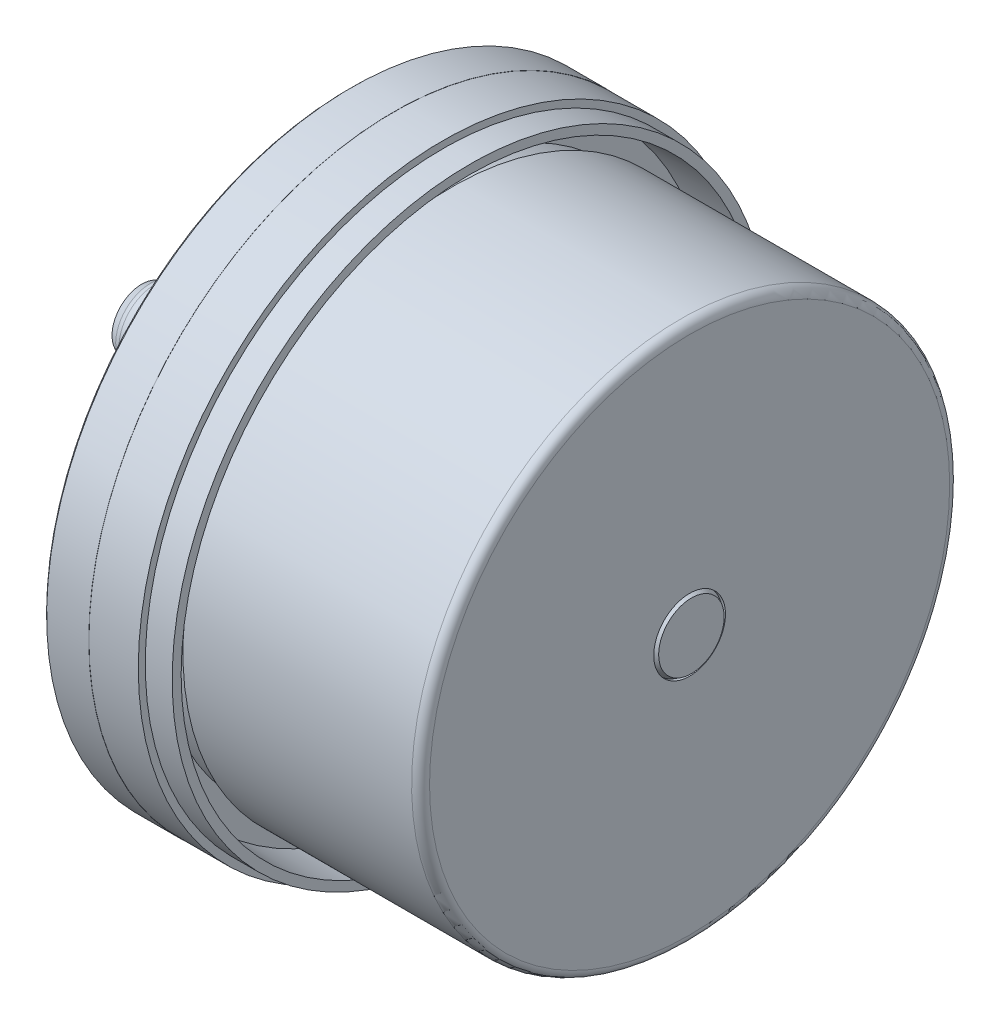
ISO-10303-21;
HEADER;
FILE_DESCRIPTION(('STEP AP214'),'2;1');
FILE_NAME('part.step','',(''),(''),'','','');
FILE_SCHEMA(('AUTOMOTIVE_DESIGN { 1 0 10303 214 1 1 1 1 }'));
ENDSEC;
DATA;
#1=APPLICATION_CONTEXT('core data for automotive mechanical design processes');
#2=APPLICATION_PROTOCOL_DEFINITION('international standard','automotive_design',2000,#1);
#3=PRODUCT_CONTEXT('',#1,'mechanical');
#4=PRODUCT('Part','Part','',(#3));
#5=PRODUCT_RELATED_PRODUCT_CATEGORY('part','',(#4));
#6=PRODUCT_DEFINITION_FORMATION('','',#4);
#7=PRODUCT_DEFINITION_CONTEXT('part definition',#1,'design');
#8=PRODUCT_DEFINITION('design','',#6,#7);
#9=PRODUCT_DEFINITION_SHAPE('','',#8);
#10=(LENGTH_UNIT() NAMED_UNIT(*) SI_UNIT(.MILLI.,.METRE.));
#11=(NAMED_UNIT(*) PLANE_ANGLE_UNIT() SI_UNIT($,.RADIAN.));
#12=(NAMED_UNIT(*) SI_UNIT($,.STERADIAN.) SOLID_ANGLE_UNIT());
#13=UNCERTAINTY_MEASURE_WITH_UNIT(LENGTH_MEASURE(1.E-05),#10,'distance_accuracy_value','');
#14=(GEOMETRIC_REPRESENTATION_CONTEXT(3) GLOBAL_UNCERTAINTY_ASSIGNED_CONTEXT((#13)) GLOBAL_UNIT_ASSIGNED_CONTEXT((#10,
#11,#12)) REPRESENTATION_CONTEXT('',''));
#15=CARTESIAN_POINT('',(0.,0.,0.));
#16=DIRECTION('',(0.,0.,1.));
#17=DIRECTION('',(1.,0.,0.));
#18=AXIS2_PLACEMENT_3D('',#15,#16,#17);
#19=CARTESIAN_POINT('',(38.2,0.,0.));
#20=DIRECTION('',(1.,0.,0.));
#21=DIRECTION('',(0.,0.,-1.));
#22=AXIS2_PLACEMENT_3D('',#19,#20,#21);
#23=PLANE('',#22);
#24=CARTESIAN_POINT('',(38.2000000000176,0.,0.));
#25=DIRECTION('',(-1.,0.,0.));
#26=DIRECTION('',(0.,0.,1.));
#27=AXIS2_PLACEMENT_3D('',#24,#25,#26);
#28=CIRCLE('',#27,3.65358983846758);
#29=CARTESIAN_POINT('',(38.2000000000176,0.,3.65358983846758));
#30=VERTEX_POINT('',#29);
#31=EDGE_CURVE('E276',#30,#30,#28,.T.);
#32=ORIENTED_EDGE('',*,*,#31,.F.);
#33=EDGE_LOOP('',(#32));
#34=FACE_BOUND('',#33,.T.);
#35=ADVANCED_FACE('F16',(#34),#23,.T.);
#36=CARTESIAN_POINT('',(37.600000000225,0.,0.));
#37=DIRECTION('',(-1.,0.,0.));
#38=DIRECTION('',(0.,0.,1.));
#39=AXIS2_PLACEMENT_3D('',#36,#37,#38);
#40=CONICAL_SURFACE('',#39,3.99999999984857,0.523598775582039);
#41=CARTESIAN_POINT('',(37.6,0.,0.));
#42=DIRECTION('',(1.,0.,0.));
#43=DIRECTION('',(0.,0.,-1.));
#44=AXIS2_PLACEMENT_3D('',#41,#42,#43);
#45=CIRCLE('',#44,4.);
#46=CARTESIAN_POINT('',(37.6,0.,-4.));
#47=VERTEX_POINT('',#46);
#48=EDGE_CURVE('E279',#47,#47,#45,.T.);
#49=ORIENTED_EDGE('',*,*,#48,.T.);
#50=EDGE_LOOP('',(#49));
#51=FACE_BOUND('',#50,.T.);
#52=ORIENTED_EDGE('',*,*,#31,.T.);
#53=EDGE_LOOP('',(#52));
#54=FACE_BOUND('',#53,.T.);
#55=ADVANCED_FACE('F97',(#51,#54),#40,.T.);
#56=CARTESIAN_POINT('',(-26.165,0.,0.));
#57=DIRECTION('',(1.,0.,0.));
#58=DIRECTION('',(0.,0.,-1.));
#59=AXIS2_PLACEMENT_3D('',#56,#57,#58);
#60=CYLINDRICAL_SURFACE('',#59,4.);
#61=CARTESIAN_POINT('',(38.,0.,0.));
#62=DIRECTION('',(1.,0.,0.));
#63=DIRECTION('',(0.,0.,-1.));
#64=AXIS2_PLACEMENT_3D('',#61,#62,#63);
#65=CIRCLE('',#64,4.);
#66=CARTESIAN_POINT('',(38.,0.,-4.));
#67=VERTEX_POINT('',#66);
#68=EDGE_CURVE('E68',#67,#67,#65,.F.);
#69=ORIENTED_EDGE('',*,*,#68,.F.);
#70=EDGE_LOOP('',(#69));
#71=FACE_BOUND('',#70,.T.);
#72=ORIENTED_EDGE('',*,*,#48,.F.);
#73=EDGE_LOOP('',(#72));
#74=FACE_BOUND('',#73,.T.);
#75=ADVANCED_FACE('F84',(#71,#74),#60,.F.);
#76=CARTESIAN_POINT('',(38.,0.,0.));
#77=DIRECTION('',(1.,0.,0.));
#78=DIRECTION('',(0.,0.,-1.));
#79=AXIS2_PLACEMENT_3D('',#76,#77,#78);
#80=PLANE('',#79);
#81=ORIENTED_EDGE('',*,*,#68,.T.);
#82=EDGE_LOOP('',(#81));
#83=FACE_BOUND('',#82,.T.);
#84=CARTESIAN_POINT('',(38.,0.,0.));
#85=DIRECTION('',(-1.,0.,0.));
#86=DIRECTION('',(0.,-1.,0.));
#87=AXIS2_PLACEMENT_3D('',#84,#85,#86);
#88=CIRCLE('',#87,29.);
#89=CARTESIAN_POINT('',(38.,-29.,0.));
#90=VERTEX_POINT('',#89);
#91=CARTESIAN_POINT('',(38.,29.,0.));
#92=VERTEX_POINT('',#91);
#93=EDGE_CURVE('E55',#90,#92,#88,.T.);
#94=ORIENTED_EDGE('',*,*,#93,.F.);
#95=CARTESIAN_POINT('',(38.,0.,0.));
#96=DIRECTION('',(-1.,0.,0.));
#97=DIRECTION('',(0.,1.,0.));
#98=AXIS2_PLACEMENT_3D('',#95,#96,#97);
#99=CIRCLE('',#98,29.);
#100=EDGE_CURVE('E57',#92,#90,#99,.T.);
#101=ORIENTED_EDGE('',*,*,#100,.F.);
#102=EDGE_LOOP('',(#94,#101));
#103=FACE_BOUND('',#102,.T.);
#104=ADVANCED_FACE('F67',(#83,#103),#80,.T.);
#105=CARTESIAN_POINT('',(37.,0.,0.));
#106=DIRECTION('',(1.,0.,0.));
#107=DIRECTION('',(0.,-1.,0.));
#108=AXIS2_PLACEMENT_3D('',#105,#106,#107);
#109=TOROIDAL_SURFACE('',#108,29.,1.);
#110=ORIENTED_EDGE('',*,*,#93,.T.);
#111=ORIENTED_EDGE('',*,*,#100,.T.);
#112=EDGE_LOOP('',(#110,#111));
#113=FACE_BOUND('',#112,.T.);
#114=CARTESIAN_POINT('',(37.,0.,0.));
#115=DIRECTION('',(1.,0.,0.));
#116=DIRECTION('',(0.,0.,-1.));
#117=AXIS2_PLACEMENT_3D('',#114,#115,#116);
#118=CIRCLE('',#117,30.);
#119=CARTESIAN_POINT('',(37.,0.,-30.));
#120=VERTEX_POINT('',#119);
#121=EDGE_CURVE('E63',#120,#120,#118,.F.);
#122=ORIENTED_EDGE('',*,*,#121,.F.);
#123=EDGE_LOOP('',(#122));
#124=FACE_BOUND('',#123,.T.);
#125=ADVANCED_FACE('F59',(#113,#124),#109,.T.);
#126=CARTESIAN_POINT('',(-26.165,0.,0.));
#127=DIRECTION('',(1.,0.,0.));
#128=DIRECTION('',(0.,0.,-1.));
#129=AXIS2_PLACEMENT_3D('',#126,#127,#128);
#130=CYLINDRICAL_SURFACE('',#129,30.);
#131=ORIENTED_EDGE('',*,*,#121,.T.);
#132=EDGE_LOOP('',(#131));
#133=FACE_BOUND('',#132,.T.);
#134=CARTESIAN_POINT('',(11.5,0.,0.));
#135=DIRECTION('',(1.,0.,0.));
#136=DIRECTION('',(0.,0.,-1.));
#137=AXIS2_PLACEMENT_3D('',#134,#135,#136);
#138=CIRCLE('',#137,30.);
#139=CARTESIAN_POINT('',(11.5,0.,-30.));
#140=VERTEX_POINT('',#139);
#141=EDGE_CURVE('E282',#140,#140,#138,.T.);
#142=ORIENTED_EDGE('',*,*,#141,.T.);
#143=EDGE_LOOP('',(#142));
#144=FACE_BOUND('',#143,.T.);
#145=ADVANCED_FACE('F452',(#133,#144),#130,.T.);
#146=CARTESIAN_POINT('',(11.5,0.,0.));
#147=DIRECTION('',(1.,0.,0.));
#148=DIRECTION('',(0.,0.,-1.));
#149=AXIS2_PLACEMENT_3D('',#146,#147,#148);
#150=PLANE('',#149);
#151=CARTESIAN_POINT('',(11.5,0.,0.));
#152=DIRECTION('',(1.,0.,0.));
#153=DIRECTION('',(0.,0.,-1.));
#154=AXIS2_PLACEMENT_3D('',#151,#152,#153);
#155=CIRCLE('',#154,29.);
#156=CARTESIAN_POINT('',(11.5,0.,-29.));
#157=VERTEX_POINT('',#156);
#158=EDGE_CURVE('E285',#157,#157,#155,.F.);
#159=ORIENTED_EDGE('',*,*,#158,.F.);
#160=EDGE_LOOP('',(#159));
#161=FACE_BOUND('',#160,.T.);
#162=ORIENTED_EDGE('',*,*,#141,.F.);
#163=EDGE_LOOP('',(#162));
#164=FACE_BOUND('',#163,.T.);
#165=ADVANCED_FACE('F449',(#161,#164),#150,.F.);
#166=CARTESIAN_POINT('',(-26.165,0.,0.));
#167=DIRECTION('',(1.,0.,0.));
#168=DIRECTION('',(0.,0.,-1.));
#169=AXIS2_PLACEMENT_3D('',#166,#167,#168);
#170=CYLINDRICAL_SURFACE('',#169,29.);
#171=CARTESIAN_POINT('',(7.8,0.,0.));
#172=DIRECTION('',(1.,0.,0.));
#173=DIRECTION('',(0.,0.,-1.));
#174=AXIS2_PLACEMENT_3D('',#171,#172,#173);
#175=CIRCLE('',#174,29.);
#176=CARTESIAN_POINT('',(7.8,0.,-29.));
#177=VERTEX_POINT('',#176);
#178=EDGE_CURVE('E288',#177,#177,#175,.F.);
#179=ORIENTED_EDGE('',*,*,#178,.F.);
#180=EDGE_LOOP('',(#179));
#181=FACE_BOUND('',#180,.T.);
#182=ORIENTED_EDGE('',*,*,#158,.T.);
#183=EDGE_LOOP('',(#182));
#184=FACE_BOUND('',#183,.T.);
#185=ADVANCED_FACE('F445',(#181,#184),#170,.T.);
#186=CARTESIAN_POINT('',(7.8,0.,0.));
#187=DIRECTION('',(1.,0.,0.));
#188=DIRECTION('',(0.,0.,-1.));
#189=AXIS2_PLACEMENT_3D('',#186,#187,#188);
#190=PLANE('',#189);
#191=ORIENTED_EDGE('',*,*,#178,.T.);
#192=EDGE_LOOP('',(#191));
#193=FACE_BOUND('',#192,.T.);
#194=CARTESIAN_POINT('',(7.80000000000003,0.,0.));
#195=DIRECTION('',(1.,0.,0.));
#196=DIRECTION('',(0.,0.,-1.));
#197=AXIS2_PLACEMENT_3D('',#194,#195,#196);
#198=CIRCLE('',#197,32.0009516138985);
#199=CARTESIAN_POINT('',(7.80000000000003,0.,-32.0009516138985));
#200=VERTEX_POINT('',#199);
#201=EDGE_CURVE('E291',#200,#200,#198,.T.);
#202=ORIENTED_EDGE('',*,*,#201,.T.);
#203=EDGE_LOOP('',(#202));
#204=FACE_BOUND('',#203,.T.);
#205=ADVANCED_FACE('F441',(#193,#204),#190,.T.);
#206=CARTESIAN_POINT('',(-23.1,0.,0.));
#207=DIRECTION('',(1.,0.,0.));
#208=DIRECTION('',(0.,0.,-1.));
#209=AXIS2_PLACEMENT_3D('',#206,#207,#208);
#210=PLANE('',#209);
#211=CARTESIAN_POINT('',(-23.0999999999426,0.,0.));
#212=DIRECTION('',(1.,0.,0.));
#213=DIRECTION('',(0.,0.,-1.));
#214=AXIS2_PLACEMENT_3D('',#211,#212,#213);
#215=CIRCLE('',#214,3.30717967699456);
#216=CARTESIAN_POINT('',(-23.0999999999426,0.,-3.30717967699456));
#217=VERTEX_POINT('',#216);
#218=EDGE_CURVE('E294',#217,#217,#215,.T.);
#219=ORIENTED_EDGE('',*,*,#218,.F.);
#220=EDGE_LOOP('',(#219));
#221=FACE_BOUND('',#220,.T.);
#222=ADVANCED_FACE('F437',(#221),#210,.F.);
#223=CARTESIAN_POINT('',(13.5,0.,0.));
#224=DIRECTION('',(1.,0.,0.));
#225=DIRECTION('',(0.,0.,-1.));
#226=AXIS2_PLACEMENT_3D('',#223,#224,#225);
#227=CONICAL_SURFACE('',#226,32.2000000000015,0.0349065850398795);
#228=CARTESIAN_POINT('',(13.5,0.,0.));
#229=DIRECTION('',(1.,0.,0.));
#230=DIRECTION('',(0.,0.,-1.));
#231=AXIS2_PLACEMENT_3D('',#228,#229,#230);
#232=CIRCLE('',#231,32.2000000000015);
#233=CARTESIAN_POINT('',(13.5,0.,-32.2000000000015));
#234=VERTEX_POINT('',#233);
#235=EDGE_CURVE('E297',#234,#234,#232,.F.);
#236=ORIENTED_EDGE('',*,*,#235,.F.);
#237=EDGE_LOOP('',(#236));
#238=FACE_BOUND('',#237,.T.);
#239=ORIENTED_EDGE('',*,*,#201,.F.);
#240=EDGE_LOOP('',(#239));
#241=FACE_BOUND('',#240,.T.);
#242=ADVANCED_FACE('F430',(#238,#241),#227,.F.);
#243=CARTESIAN_POINT('',(-22.1320508076133,0.,0.));
#244=DIRECTION('',(1.,0.,0.));
#245=DIRECTION('',(0.,0.,-1.));
#246=AXIS2_PLACEMENT_3D('',#243,#244,#245);
#247=CONICAL_SURFACE('',#246,3.86602540373815,0.523598775590827);
#248=ORIENTED_EDGE('',*,*,#218,.T.);
#249=EDGE_LOOP('',(#248));
#250=FACE_BOUND('',#249,.T.);
#251=CARTESIAN_POINT('',(-22.1320508075698,0.,0.));
#252=DIRECTION('',(1.,0.,0.));
#253=DIRECTION('',(0.,-1.,0.));
#254=AXIS2_PLACEMENT_3D('',#251,#252,#253);
#255=CIRCLE('',#254,3.86602540378458);
#256=CARTESIAN_POINT('',(-22.1320508075698,-3.86602540378458,0.));
#257=VERTEX_POINT('',#256);
#258=EDGE_CURVE('E300',#257,#257,#255,.T.);
#259=ORIENTED_EDGE('',*,*,#258,.F.);
#260=EDGE_LOOP('',(#259));
#261=FACE_BOUND('',#260,.T.);
#262=ADVANCED_FACE('F421',(#250,#261),#247,.T.);
#263=CARTESIAN_POINT('',(13.5,0.,0.));
#264=DIRECTION('',(1.,0.,0.));
#265=DIRECTION('',(0.,0.,-1.));
#266=AXIS2_PLACEMENT_3D('',#263,#264,#265);
#267=PLANE('',#266);
#268=ORIENTED_EDGE('',*,*,#235,.T.);
#269=EDGE_LOOP('',(#268));
#270=FACE_BOUND('',#269,.T.);
#271=CARTESIAN_POINT('',(13.5,0.,0.));
#272=DIRECTION('',(1.,0.,0.));
#273=DIRECTION('',(0.,0.,-1.));
#274=AXIS2_PLACEMENT_3D('',#271,#272,#273);
#275=CIRCLE('',#274,33.2);
#276=CARTESIAN_POINT('',(13.5,0.,-33.2));
#277=VERTEX_POINT('',#276);
#278=EDGE_CURVE('E301',#277,#277,#275,.F.);
#279=ORIENTED_EDGE('',*,*,#278,.F.);
#280=EDGE_LOOP('',(#279));
#281=FACE_BOUND('',#280,.T.);
#282=ADVANCED_FACE('F419',(#270,#281),#267,.T.);
#283=CARTESIAN_POINT('',(-21.63205080757,0.,0.));
#284=DIRECTION('',(1.,0.,0.));
#285=DIRECTION('',(0.,-1.,0.));
#286=AXIS2_PLACEMENT_3D('',#283,#284,#285);
#287=TOROIDAL_SURFACE('',#286,3.,1.);
#288=ORIENTED_EDGE('',*,*,#258,.T.);
#289=EDGE_LOOP('',(#288));
#290=FACE_BOUND('',#289,.T.);
#291=CARTESIAN_POINT('',(-21.63205080757,0.,0.));
#292=DIRECTION('',(1.,0.,0.));
#293=DIRECTION('',(0.,0.,-1.));
#294=AXIS2_PLACEMENT_3D('',#291,#292,#293);
#295=CIRCLE('',#294,4.);
#296=CARTESIAN_POINT('',(-21.63205080757,0.,-4.));
#297=VERTEX_POINT('',#296);
#298=EDGE_CURVE('E304',#297,#297,#295,.T.);
#299=ORIENTED_EDGE('',*,*,#298,.F.);
#300=EDGE_LOOP('',(#299));
#301=FACE_BOUND('',#300,.T.);
#302=ADVANCED_FACE('F415',(#290,#301),#287,.T.);
#303=CARTESIAN_POINT('',(-26.165,0.,0.));
#304=DIRECTION('',(1.,0.,0.));
#305=DIRECTION('',(0.,0.,-1.));
#306=AXIS2_PLACEMENT_3D('',#303,#304,#305);
#307=CYLINDRICAL_SURFACE('',#306,33.2);
#308=CARTESIAN_POINT('',(10.5,0.,0.));
#309=DIRECTION('',(1.,0.,0.));
#310=DIRECTION('',(0.,0.,-1.));
#311=AXIS2_PLACEMENT_3D('',#308,#309,#310);
#312=CIRCLE('',#311,33.2);
#313=CARTESIAN_POINT('',(10.5,0.,-33.2));
#314=VERTEX_POINT('',#313);
#315=EDGE_CURVE('E305',#314,#314,#312,.F.);
#316=ORIENTED_EDGE('',*,*,#315,.F.);
#317=EDGE_LOOP('',(#316));
#318=FACE_BOUND('',#317,.T.);
#319=ORIENTED_EDGE('',*,*,#278,.T.);
#320=EDGE_LOOP('',(#319));
#321=FACE_BOUND('',#320,.T.);
#322=ADVANCED_FACE('F409',(#318,#321),#307,.T.);
#323=CARTESIAN_POINT('',(-26.165,0.,0.));
#324=DIRECTION('',(1.,0.,0.));
#325=DIRECTION('',(0.,0.,-1.));
#326=AXIS2_PLACEMENT_3D('',#323,#324,#325);
#327=CYLINDRICAL_SURFACE('',#326,4.);
#328=ORIENTED_EDGE('',*,*,#298,.T.);
#329=EDGE_LOOP('',(#328));
#330=FACE_BOUND('',#329,.T.);
#331=CARTESIAN_POINT('',(-2.1,0.,0.));
#332=DIRECTION('',(1.,0.,0.));
#333=DIRECTION('',(0.,-1.,0.));
#334=AXIS2_PLACEMENT_3D('',#331,#332,#333);
#335=CIRCLE('',#334,4.);
#336=CARTESIAN_POINT('',(-2.1,-4.,0.));
#337=VERTEX_POINT('',#336);
#338=EDGE_CURVE('E308',#337,#337,#335,.T.);
#339=ORIENTED_EDGE('',*,*,#338,.F.);
#340=EDGE_LOOP('',(#339));
#341=FACE_BOUND('',#340,.T.);
#342=ADVANCED_FACE('F404',(#330,#341),#327,.T.);
#343=CARTESIAN_POINT('',(10.5,0.,0.));
#344=DIRECTION('',(1.,0.,0.));
#345=DIRECTION('',(0.,0.,-1.));
#346=AXIS2_PLACEMENT_3D('',#343,#344,#345);
#347=PLANE('',#346);
#348=ORIENTED_EDGE('',*,*,#315,.T.);
#349=EDGE_LOOP('',(#348));
#350=FACE_BOUND('',#349,.T.);
#351=CARTESIAN_POINT('',(10.5,0.,0.));
#352=DIRECTION('',(1.,0.,0.));
#353=DIRECTION('',(0.,0.,-1.));
#354=AXIS2_PLACEMENT_3D('',#351,#352,#353);
#355=CIRCLE('',#354,33.98);
#356=CARTESIAN_POINT('',(10.5,0.,-33.98));
#357=VERTEX_POINT('',#356);
#358=EDGE_CURVE('E309',#357,#357,#355,.F.);
#359=ORIENTED_EDGE('',*,*,#358,.F.);
#360=EDGE_LOOP('',(#359));
#361=FACE_BOUND('',#360,.T.);
#362=ADVANCED_FACE('F247',(#350,#361),#347,.T.);
#363=CARTESIAN_POINT('',(-2.1,0.,0.));
#364=DIRECTION('',(1.,0.,0.));
#365=DIRECTION('',(0.,-1.,0.));
#366=AXIS2_PLACEMENT_3D('',#363,#364,#365);
#367=TOROIDAL_SURFACE('',#366,4.5,0.5);
#368=ORIENTED_EDGE('',*,*,#338,.T.);
#369=EDGE_LOOP('',(#368));
#370=FACE_BOUND('',#369,.T.);
#371=CARTESIAN_POINT('',(-2.6,0.,0.));
#372=DIRECTION('',(-1.,0.,0.));
#373=DIRECTION('',(0.,-1.,0.));
#374=AXIS2_PLACEMENT_3D('',#371,#372,#373);
#375=CIRCLE('',#374,4.5);
#376=CARTESIAN_POINT('',(-2.6,-4.5,0.));
#377=VERTEX_POINT('',#376);
#378=CARTESIAN_POINT('',(-2.6,4.5,0.));
#379=VERTEX_POINT('',#378);
#380=EDGE_CURVE('E222',#377,#379,#375,.T.);
#381=ORIENTED_EDGE('',*,*,#380,.T.);
#382=CARTESIAN_POINT('',(-2.6,0.,0.));
#383=DIRECTION('',(-1.,0.,0.));
#384=DIRECTION('',(0.,1.,0.));
#385=AXIS2_PLACEMENT_3D('',#382,#383,#384);
#386=CIRCLE('',#385,4.5);
#387=EDGE_CURVE('E265',#379,#377,#386,.T.);
#388=ORIENTED_EDGE('',*,*,#387,.T.);
#389=EDGE_LOOP('',(#381,#388));
#390=FACE_BOUND('',#389,.T.);
#391=ADVANCED_FACE('F243',(#370,#390),#367,.T.);
#392=CARTESIAN_POINT('',(-26.165,0.,0.));
#393=DIRECTION('',(1.,0.,0.));
#394=DIRECTION('',(0.,0.,-1.));
#395=AXIS2_PLACEMENT_3D('',#392,#393,#394);
#396=CYLINDRICAL_SURFACE('',#395,33.98);
#397=CARTESIAN_POINT('',(5.,0.,0.));
#398=DIRECTION('',(1.,0.,0.));
#399=DIRECTION('',(0.,0.,-1.));
#400=AXIS2_PLACEMENT_3D('',#397,#398,#399);
#401=CIRCLE('',#400,33.98);
#402=CARTESIAN_POINT('',(5.,0.,-33.98));
#403=VERTEX_POINT('',#402);
#404=EDGE_CURVE('E312',#403,#403,#401,.F.);
#405=ORIENTED_EDGE('',*,*,#404,.F.);
#406=EDGE_LOOP('',(#405));
#407=FACE_BOUND('',#406,.T.);
#408=ORIENTED_EDGE('',*,*,#358,.T.);
#409=EDGE_LOOP('',(#408));
#410=FACE_BOUND('',#409,.T.);
#411=ADVANCED_FACE('F202',(#407,#410),#396,.T.);
#412=CARTESIAN_POINT('',(-2.6,0.,0.));
#413=DIRECTION('',(1.,0.,0.));
#414=DIRECTION('',(0.,0.,-1.));
#415=AXIS2_PLACEMENT_3D('',#412,#413,#414);
#416=PLANE('',#415);
#417=ORIENTED_EDGE('',*,*,#387,.F.);
#418=ORIENTED_EDGE('',*,*,#380,.F.);
#419=EDGE_LOOP('',(#417,#418));
#420=FACE_BOUND('',#419,.T.);
#421=CARTESIAN_POINT('',(-2.6,0.,0.));
#422=DIRECTION('',(1.,0.,0.));
#423=DIRECTION('',(0.,1.,0.));
#424=AXIS2_PLACEMENT_3D('',#421,#422,#423);
#425=CIRCLE('',#424,10.5);
#426=CARTESIAN_POINT('',(-2.6,10.5,0.));
#427=VERTEX_POINT('',#426);
#428=CARTESIAN_POINT('',(-2.6,-10.5,0.));
#429=VERTEX_POINT('',#428);
#430=EDGE_CURVE('E188',#427,#429,#425,.T.);
#431=ORIENTED_EDGE('',*,*,#430,.F.);
#432=CARTESIAN_POINT('',(-2.6,0.,0.));
#433=DIRECTION('',(1.,0.,0.));
#434=DIRECTION('',(0.,-1.,0.));
#435=AXIS2_PLACEMENT_3D('',#432,#433,#434);
#436=CIRCLE('',#435,10.5);
#437=EDGE_CURVE('E275',#429,#427,#436,.T.);
#438=ORIENTED_EDGE('',*,*,#437,.F.);
#439=EDGE_LOOP('',(#431,#438));
#440=FACE_BOUND('',#439,.T.);
#441=ADVANCED_FACE('F193',(#420,#440),#416,.F.);
#442=CARTESIAN_POINT('',(5.,0.,0.));
#443=DIRECTION('',(1.,0.,0.));
#444=DIRECTION('',(0.,0.,-1.));
#445=AXIS2_PLACEMENT_3D('',#442,#443,#444);
#446=PLANE('',#445);
#447=ORIENTED_EDGE('',*,*,#404,.T.);
#448=EDGE_LOOP('',(#447));
#449=FACE_BOUND('',#448,.T.);
#450=CARTESIAN_POINT('',(5.,0.,0.));
#451=DIRECTION('',(1.,0.,0.));
#452=DIRECTION('',(0.,0.,-1.));
#453=AXIS2_PLACEMENT_3D('',#450,#451,#452);
#454=CIRCLE('',#453,34.);
#455=CARTESIAN_POINT('',(5.,0.,-34.));
#456=VERTEX_POINT('',#455);
#457=EDGE_CURVE('E315',#456,#456,#454,.F.);
#458=ORIENTED_EDGE('',*,*,#457,.F.);
#459=EDGE_LOOP('',(#458));
#460=FACE_BOUND('',#459,.T.);
#461=ADVANCED_FACE('F174',(#449,#460),#446,.T.);
#462=CARTESIAN_POINT('',(-2.1,0.,0.));
#463=DIRECTION('',(1.,0.,0.));
#464=DIRECTION('',(0.,-1.,0.));
#465=AXIS2_PLACEMENT_3D('',#462,#463,#464);
#466=TOROIDAL_SURFACE('',#465,10.5,0.5);
#467=ORIENTED_EDGE('',*,*,#437,.T.);
#468=ORIENTED_EDGE('',*,*,#430,.T.);
#469=EDGE_LOOP('',(#467,#468));
#470=FACE_BOUND('',#469,.T.);
#471=CARTESIAN_POINT('',(-2.1,0.,0.));
#472=DIRECTION('',(1.,0.,0.));
#473=DIRECTION('',(0.,0.,-1.));
#474=AXIS2_PLACEMENT_3D('',#471,#472,#473);
#475=CIRCLE('',#474,11.);
#476=CARTESIAN_POINT('',(-2.1,0.,-11.));
#477=VERTEX_POINT('',#476);
#478=EDGE_CURVE('E182',#477,#477,#475,.T.);
#479=ORIENTED_EDGE('',*,*,#478,.F.);
#480=EDGE_LOOP('',(#479));
#481=FACE_BOUND('',#480,.T.);
#482=ADVANCED_FACE('F168',(#470,#481),#466,.T.);
#483=CARTESIAN_POINT('',(7.30000000004338,21.5,0.));
#484=DIRECTION('',(-1.,0.,0.));
#485=DIRECTION('',(0.,0.,1.));
#486=AXIS2_PLACEMENT_3D('',#483,#484,#485);
#487=CONICAL_SURFACE('',#486,1.65000000004374,1.02974425866086);
#488=CARTESIAN_POINT('',(7.3,21.5,0.));
#489=DIRECTION('',(-1.,0.,0.));
#490=DIRECTION('',(0.,0.,1.));
#491=AXIS2_PLACEMENT_3D('',#488,#489,#490);
#492=CIRCLE('',#491,1.65);
#493=CARTESIAN_POINT('',(7.3,21.5,1.65));
#494=VERTEX_POINT('',#493);
#495=EDGE_CURVE('E371',#494,#494,#492,.T.);
#496=ORIENTED_EDGE('',*,*,#495,.T.);
#497=EDGE_LOOP('',(#496));
#498=FACE_BOUND('',#497,.T.);
#499=CARTESIAN_POINT('',(8.29142002149297,21.4999999999463,0.));
#500=VERTEX_POINT('',#499);
#501=VERTEX_LOOP('',#500);
#502=FACE_BOUND('',#501,.T.);
#503=ADVANCED_FACE('F164',(#498,#502),#487,.F.);
#504=CARTESIAN_POINT('',(7.2999999999297,-10.75,18.61954618137));
#505=DIRECTION('',(-1.,0.,0.));
#506=DIRECTION('',(0.,0.,1.));
#507=AXIS2_PLACEMENT_3D('',#504,#505,#506);
#508=CONICAL_SURFACE('',#507,1.65000000009943,1.02974425865758);
#509=CARTESIAN_POINT('',(7.3,-10.75,18.61954618137));
#510=DIRECTION('',(-1.,0.,0.));
#511=DIRECTION('',(0.,0.,1.));
#512=AXIS2_PLACEMENT_3D('',#509,#510,#511);
#513=CIRCLE('',#512,1.65);
#514=CARTESIAN_POINT('',(7.3,-10.75,20.26954618137));
#515=VERTEX_POINT('',#514);
#516=EDGE_CURVE('E369',#515,#515,#513,.T.);
#517=ORIENTED_EDGE('',*,*,#516,.T.);
#518=EDGE_LOOP('',(#517));
#519=FACE_BOUND('',#518,.T.);
#520=CARTESIAN_POINT('',(8.2914200214077,-10.75,18.61954618137));
#521=VERTEX_POINT('',#520);
#522=VERTEX_LOOP('',#521);
#523=FACE_BOUND('',#522,.T.);
#524=ADVANCED_FACE('F160',(#519,#523),#508,.F.);
#525=CARTESIAN_POINT('',(7.2999999999297,-10.75,-18.61954618137));
#526=DIRECTION('',(-1.,0.,0.));
#527=DIRECTION('',(0.,0.,1.));
#528=AXIS2_PLACEMENT_3D('',#525,#526,#527);
#529=CONICAL_SURFACE('',#528,1.65000000009943,1.02974425865758);
#530=CARTESIAN_POINT('',(7.3,-10.75,-18.61954618137));
#531=DIRECTION('',(-1.,0.,0.));
#532=DIRECTION('',(0.,0.,1.));
#533=AXIS2_PLACEMENT_3D('',#530,#531,#532);
#534=CIRCLE('',#533,1.65);
#535=CARTESIAN_POINT('',(7.3,-10.75,-16.96954618137));
#536=VERTEX_POINT('',#535);
#537=EDGE_CURVE('E366',#536,#536,#534,.T.);
#538=ORIENTED_EDGE('',*,*,#537,.T.);
#539=EDGE_LOOP('',(#538));
#540=FACE_BOUND('',#539,.T.);
#541=CARTESIAN_POINT('',(8.2914200214077,-10.75,-18.61954618137));
#542=VERTEX_POINT('',#541);
#543=VERTEX_LOOP('',#542);
#544=FACE_BOUND('',#543,.T.);
#545=ADVANCED_FACE('F156',(#540,#544),#529,.F.);
#546=CARTESIAN_POINT('',(-26.165,0.,0.));
#547=DIRECTION('',(1.,0.,0.));
#548=DIRECTION('',(0.,0.,-1.));
#549=AXIS2_PLACEMENT_3D('',#546,#547,#548);
#550=CYLINDRICAL_SURFACE('',#549,34.);
#551=ORIENTED_EDGE('',*,*,#457,.T.);
#552=EDGE_LOOP('',(#551));
#553=FACE_BOUND('',#552,.T.);
#554=CARTESIAN_POINT('',(0.300000000000022,0.,0.));
#555=DIRECTION('',(1.,0.,0.));
#556=DIRECTION('',(0.,-1.,0.));
#557=AXIS2_PLACEMENT_3D('',#554,#555,#556);
#558=CIRCLE('',#557,34.);
#559=CARTESIAN_POINT('',(0.300000000000021,-34.,0.));
#560=VERTEX_POINT('',#559);
#561=EDGE_CURVE('E363',#560,#560,#558,.F.);
#562=ORIENTED_EDGE('',*,*,#561,.F.);
#563=EDGE_LOOP('',(#562));
#564=FACE_BOUND('',#563,.T.);
#565=ADVANCED_FACE('F152',(#553,#564),#550,.T.);
#566=CARTESIAN_POINT('',(-26.165,0.,0.));
#567=DIRECTION('',(1.,0.,0.));
#568=DIRECTION('',(0.,0.,-1.));
#569=AXIS2_PLACEMENT_3D('',#566,#567,#568);
#570=CYLINDRICAL_SURFACE('',#569,11.);
#571=ORIENTED_EDGE('',*,*,#478,.T.);
#572=EDGE_LOOP('',(#571));
#573=FACE_BOUND('',#572,.T.);
#574=CARTESIAN_POINT('',(0.500000000001138,0.,0.));
#575=DIRECTION('',(-1.,0.,0.));
#576=DIRECTION('',(0.,1.,0.));
#577=AXIS2_PLACEMENT_3D('',#574,#575,#576);
#578=CIRCLE('',#577,11.000000000002);
#579=CARTESIAN_POINT('',(0.500000000001138,11.000000000002,0.));
#580=VERTEX_POINT('',#579);
#581=EDGE_CURVE('E360',#580,#580,#578,.T.);
#582=ORIENTED_EDGE('',*,*,#581,.T.);
#583=EDGE_LOOP('',(#582));
#584=FACE_BOUND('',#583,.T.);
#585=ADVANCED_FACE('F148',(#573,#584),#570,.T.);
#586=CARTESIAN_POINT('',(8.705991022465,21.5,0.));
#587=DIRECTION('',(-1.,0.,0.));
#588=DIRECTION('',(0.,0.,1.));
#589=AXIS2_PLACEMENT_3D('',#586,#587,#588);
#590=CYLINDRICAL_SURFACE('',#589,1.65);
#591=CARTESIAN_POINT('',(0.549999999975626,21.5,0.));
#592=DIRECTION('',(-1.,0.,0.));
#593=DIRECTION('',(0.,1.,0.));
#594=AXIS2_PLACEMENT_3D('',#591,#592,#593);
#595=CIRCLE('',#594,1.64999999993006);
#596=CARTESIAN_POINT('',(0.549999999975626,23.1499999999301,0.));
#597=VERTEX_POINT('',#596);
#598=EDGE_CURVE('E355',#597,#597,#595,.T.);
#599=ORIENTED_EDGE('',*,*,#598,.T.);
#600=EDGE_LOOP('',(#599));
#601=FACE_BOUND('',#600,.T.);
#602=ORIENTED_EDGE('',*,*,#495,.F.);
#603=EDGE_LOOP('',(#602));
#604=FACE_BOUND('',#603,.T.);
#605=ADVANCED_FACE('F144',(#601,#604),#590,.F.);
#606=CARTESIAN_POINT('',(8.705991022465,-10.75,18.61954618137));
#607=DIRECTION('',(-1.,0.,0.));
#608=DIRECTION('',(0.,0.,1.));
#609=AXIS2_PLACEMENT_3D('',#606,#607,#608);
#610=CYLINDRICAL_SURFACE('',#609,1.65);
#611=CARTESIAN_POINT('',(0.550000000032469,-10.75,18.61954618137));
#612=DIRECTION('',(-1.,0.,0.));
#613=DIRECTION('',(0.,-0.500000000004348,0.866025403781928));
#614=AXIS2_PLACEMENT_3D('',#611,#612,#613);
#615=CIRCLE('',#614,1.64999999997255);
#616=CARTESIAN_POINT('',(0.550000000032469,-11.5749999999935,20.0484880975864));
#617=VERTEX_POINT('',#616);
#618=EDGE_CURVE('E351',#617,#617,#615,.T.);
#619=ORIENTED_EDGE('',*,*,#618,.T.);
#620=EDGE_LOOP('',(#619));
#621=FACE_BOUND('',#620,.T.);
#622=ORIENTED_EDGE('',*,*,#516,.F.);
#623=EDGE_LOOP('',(#622));
#624=FACE_BOUND('',#623,.T.);
#625=ADVANCED_FACE('F140',(#621,#624),#610,.F.);
#626=CARTESIAN_POINT('',(8.705991022465,-10.75,-18.61954618137));
#627=DIRECTION('',(-1.,0.,0.));
#628=DIRECTION('',(0.,0.,1.));
#629=AXIS2_PLACEMENT_3D('',#626,#627,#628);
#630=CYLINDRICAL_SURFACE('',#629,1.65);
#631=CARTESIAN_POINT('',(0.550000000032469,-10.75,-18.61954618137));
#632=DIRECTION('',(-1.,0.,0.));
#633=DIRECTION('',(0.,-0.500000000004348,-0.866025403781928));
#634=AXIS2_PLACEMENT_3D('',#631,#632,#633);
#635=CIRCLE('',#634,1.64999999997255);
#636=CARTESIAN_POINT('',(0.550000000032469,-11.5749999999935,-20.0484880975864));
#637=VERTEX_POINT('',#636);
#638=EDGE_CURVE('E322',#637,#637,#635,.T.);
#639=ORIENTED_EDGE('',*,*,#638,.T.);
#640=EDGE_LOOP('',(#639));
#641=FACE_BOUND('',#640,.T.);
#642=ORIENTED_EDGE('',*,*,#537,.F.);
#643=EDGE_LOOP('',(#642));
#644=FACE_BOUND('',#643,.T.);
#645=ADVANCED_FACE('F136',(#641,#644),#630,.F.);
#646=CARTESIAN_POINT('',(0.300000000000021,0.,0.));
#647=DIRECTION('',(1.,0.,0.));
#648=DIRECTION('',(0.,0.,-1.));
#649=AXIS2_PLACEMENT_3D('',#646,#647,#648);
#650=CONICAL_SURFACE('',#649,34.,0.785398163397298);
#651=ORIENTED_EDGE('',*,*,#561,.T.);
#652=EDGE_LOOP('',(#651));
#653=FACE_BOUND('',#652,.T.);
#654=CARTESIAN_POINT('',(0.,0.,0.));
#655=DIRECTION('',(1.,0.,0.));
#656=DIRECTION('',(0.,0.,-1.));
#657=AXIS2_PLACEMENT_3D('',#654,#655,#656);
#658=CIRCLE('',#657,33.7);
#659=CARTESIAN_POINT('',(0.,0.,-33.7));
#660=VERTEX_POINT('',#659);
#661=EDGE_CURVE('E318',#660,#660,#658,.T.);
#662=ORIENTED_EDGE('',*,*,#661,.T.);
#663=EDGE_LOOP('',(#662));
#664=FACE_BOUND('',#663,.T.);
#665=ADVANCED_FACE('F132',(#653,#664),#650,.T.);
#666=CARTESIAN_POINT('',(3.19059015319034E-12,0.,0.));
#667=DIRECTION('',(-1.,0.,0.));
#668=DIRECTION('',(0.,0.,1.));
#669=AXIS2_PLACEMENT_3D('',#666,#667,#668);
#670=CONICAL_SURFACE('',#669,11.2886751345955,0.5235987755982);
#671=ORIENTED_EDGE('',*,*,#581,.F.);
#672=EDGE_LOOP('',(#671));
#673=FACE_BOUND('',#672,.T.);
#674=CARTESIAN_POINT('',(3.19189119579733E-12,0.,0.));
#675=DIRECTION('',(-1.,0.,0.));
#676=DIRECTION('',(0.,0.,1.));
#677=AXIS2_PLACEMENT_3D('',#674,#675,#676);
#678=CIRCLE('',#677,11.2886751345955);
#679=CARTESIAN_POINT('',(3.19189119579733E-12,0.,11.2886751345955));
#680=VERTEX_POINT('',#679);
#681=EDGE_CURVE('E321',#680,#680,#678,.T.);
#682=ORIENTED_EDGE('',*,*,#681,.T.);
#683=EDGE_LOOP('',(#682));
#684=FACE_BOUND('',#683,.T.);
#685=ADVANCED_FACE('F128',(#673,#684),#670,.F.);
#686=CARTESIAN_POINT('',(0.,21.5,0.));
#687=DIRECTION('',(-1.,0.,0.));
#688=DIRECTION('',(0.,0.,1.));
#689=AXIS2_PLACEMENT_3D('',#686,#687,#688);
#690=CONICAL_SURFACE('',#689,2.19999999990568,0.785398163397448);
#691=ORIENTED_EDGE('',*,*,#598,.F.);
#692=EDGE_LOOP('',(#691));
#693=FACE_BOUND('',#692,.T.);
#694=CARTESIAN_POINT('',(0.,21.5,0.));
#695=DIRECTION('',(-1.,0.,0.));
#696=DIRECTION('',(0.,0.,1.));
#697=AXIS2_PLACEMENT_3D('',#694,#695,#696);
#698=CIRCLE('',#697,2.19999999990568);
#699=CARTESIAN_POINT('',(0.,21.5,2.19999999990568));
#700=VERTEX_POINT('',#699);
#701=EDGE_CURVE('E325',#700,#700,#698,.T.);
#702=ORIENTED_EDGE('',*,*,#701,.T.);
#703=EDGE_LOOP('',(#702));
#704=FACE_BOUND('',#703,.T.);
#705=ADVANCED_FACE('F124',(#693,#704),#690,.F.);
#706=CARTESIAN_POINT('',(5.6843418860808E-11,-10.75,18.61954618137));
#707=DIRECTION('',(-1.,0.,0.));
#708=DIRECTION('',(0.,0.,1.));
#709=AXIS2_PLACEMENT_3D('',#706,#707,#708);
#710=CONICAL_SURFACE('',#709,2.1999999999462,0.785398163414567);
#711=ORIENTED_EDGE('',*,*,#618,.F.);
#712=EDGE_LOOP('',(#711));
#713=FACE_BOUND('',#712,.T.);
#714=CARTESIAN_POINT('',(-5.58234014530762E-11,-10.75,18.61954618137));
#715=DIRECTION('',(-1.,0.,0.));
#716=DIRECTION('',(0.,0.,1.));
#717=AXIS2_PLACEMENT_3D('',#714,#715,#716);
#718=CIRCLE('',#717,2.20000000005887);
#719=CARTESIAN_POINT('',(-5.58234014530762E-11,-10.75,20.8195461814289));
#720=VERTEX_POINT('',#719);
#721=EDGE_CURVE('E27',#720,#720,#718,.T.);
#722=ORIENTED_EDGE('',*,*,#721,.T.);
#723=EDGE_LOOP('',(#722));
#724=FACE_BOUND('',#723,.T.);
#725=ADVANCED_FACE('F116',(#713,#724),#710,.F.);
#726=CARTESIAN_POINT('',(5.6843418860808E-11,-10.75,-18.61954618137));
#727=DIRECTION('',(-1.,0.,0.));
#728=DIRECTION('',(0.,0.,1.));
#729=AXIS2_PLACEMENT_3D('',#726,#727,#728);
#730=CONICAL_SURFACE('',#729,2.1999999999462,0.785398163414567);
#731=ORIENTED_EDGE('',*,*,#638,.F.);
#732=EDGE_LOOP('',(#731));
#733=FACE_BOUND('',#732,.T.);
#734=CARTESIAN_POINT('',(-5.58234014530762E-11,-10.75,-18.61954618137));
#735=DIRECTION('',(-1.,0.,0.));
#736=DIRECTION('',(0.,0.,1.));
#737=AXIS2_PLACEMENT_3D('',#734,#735,#736);
#738=CIRCLE('',#737,2.20000000005887);
#739=CARTESIAN_POINT('',(-5.58234014530762E-11,-10.75,-16.4195461813111));
#740=VERTEX_POINT('',#739);
#741=EDGE_CURVE('E11',#740,#740,#738,.T.);
#742=ORIENTED_EDGE('',*,*,#741,.T.);
#743=EDGE_LOOP('',(#742));
#744=FACE_BOUND('',#743,.T.);
#745=ADVANCED_FACE('F110',(#733,#744),#730,.F.);
#746=CARTESIAN_POINT('',(0.,0.,0.));
#747=DIRECTION('',(1.,0.,0.));
#748=DIRECTION('',(0.,0.,-1.));
#749=AXIS2_PLACEMENT_3D('',#746,#747,#748);
#750=PLANE('',#749);
#751=ORIENTED_EDGE('',*,*,#741,.F.);
#752=EDGE_LOOP('',(#751));
#753=FACE_BOUND('',#752,.T.);
#754=ORIENTED_EDGE('',*,*,#721,.F.);
#755=EDGE_LOOP('',(#754));
#756=FACE_BOUND('',#755,.T.);
#757=ORIENTED_EDGE('',*,*,#701,.F.);
#758=EDGE_LOOP('',(#757));
#759=FACE_BOUND('',#758,.T.);
#760=ORIENTED_EDGE('',*,*,#681,.F.);
#761=EDGE_LOOP('',(#760));
#762=FACE_BOUND('',#761,.T.);
#763=ORIENTED_EDGE('',*,*,#661,.F.);
#764=EDGE_LOOP('',(#763));
#765=FACE_BOUND('',#764,.T.);
#766=ADVANCED_FACE('F108',(#753,#756,#759,#762,#765),#750,.F.);
#767=CLOSED_SHELL('',(#35,#55,#75,#104,#125,#145,#165,#185,#205,#222,#242,#262,#282,#302,#322,
#342,#362,#391,#411,#441,#461,#482,#503,#524,#545,#565,#585,#605,#625,#645,#665,#685,#705,#725,
#745,#766));
#768=MANIFOLD_SOLID_BREP('B1',#767);
#769=ADVANCED_BREP_SHAPE_REPRESENTATION('',(#18,#768),#14);
#770=SHAPE_DEFINITION_REPRESENTATION(#9,#769);
ENDSEC;
END-ISO-10303-21;
